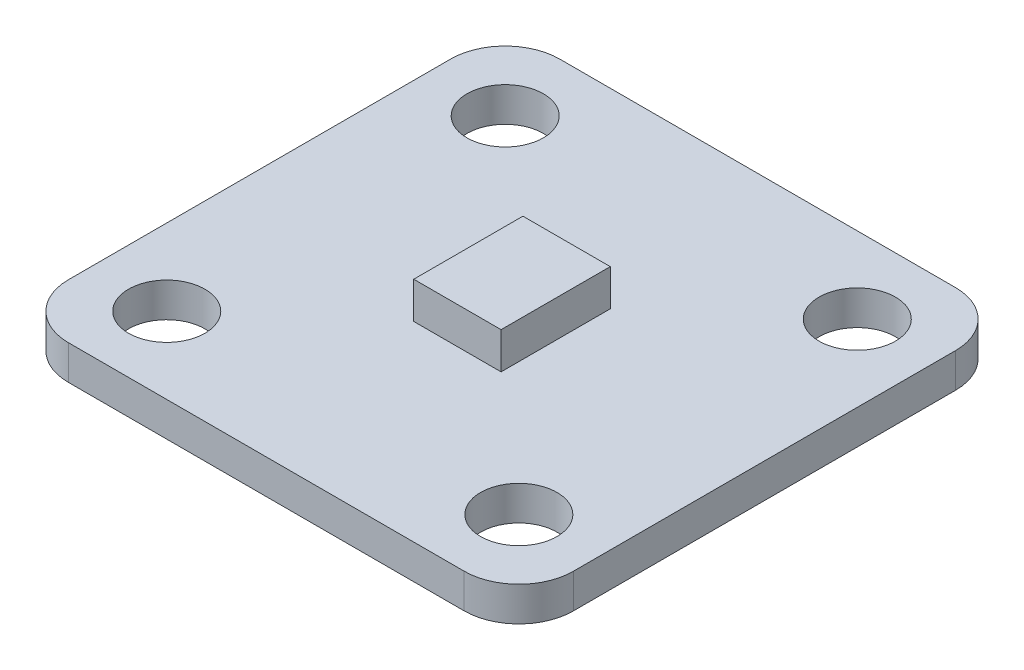
ISO-10303-21;
HEADER;
FILE_DESCRIPTION(('STEP AP214'),'2;1');
FILE_NAME('part.step','',(''),(''),'','','');
FILE_SCHEMA(('AUTOMOTIVE_DESIGN { 1 0 10303 214 1 1 1 1 }'));
ENDSEC;
DATA;
#1=APPLICATION_CONTEXT('core data for automotive mechanical design processes');
#2=APPLICATION_PROTOCOL_DEFINITION('international standard','automotive_design',2000,#1);
#3=PRODUCT_CONTEXT('',#1,'mechanical');
#4=PRODUCT('Part','Part','',(#3));
#5=PRODUCT_RELATED_PRODUCT_CATEGORY('part','',(#4));
#6=PRODUCT_DEFINITION_FORMATION('','',#4);
#7=PRODUCT_DEFINITION_CONTEXT('part definition',#1,'design');
#8=PRODUCT_DEFINITION('design','',#6,#7);
#9=PRODUCT_DEFINITION_SHAPE('','',#8);
#10=(LENGTH_UNIT() NAMED_UNIT(*) SI_UNIT(.MILLI.,.METRE.));
#11=(NAMED_UNIT(*) PLANE_ANGLE_UNIT() SI_UNIT($,.RADIAN.));
#12=(NAMED_UNIT(*) SI_UNIT($,.STERADIAN.) SOLID_ANGLE_UNIT());
#13=UNCERTAINTY_MEASURE_WITH_UNIT(LENGTH_MEASURE(1.E-05),#10,'distance_accuracy_value','');
#14=(GEOMETRIC_REPRESENTATION_CONTEXT(3) GLOBAL_UNCERTAINTY_ASSIGNED_CONTEXT((#13)) GLOBAL_UNIT_ASSIGNED_CONTEXT((#10,
#11,#12)) REPRESENTATION_CONTEXT('',''));
#15=CARTESIAN_POINT('',(0.,0.,0.));
#16=DIRECTION('',(0.,0.,1.));
#17=DIRECTION('',(1.,0.,0.));
#18=AXIS2_PLACEMENT_3D('',#15,#16,#17);
#19=CARTESIAN_POINT('',(0.,1.6002,0.));
#20=DIRECTION('',(0.,-1.,0.));
#21=DIRECTION('',(0.,0.,-1.));
#22=AXIS2_PLACEMENT_3D('',#19,#20,#21);
#23=PLANE('',#22);
#24=CARTESIAN_POINT('',(8.1915,1.6002,7.874));
#25=DIRECTION('',(0.,1.,0.));
#26=DIRECTION('',(0.,0.,1.));
#27=AXIS2_PLACEMENT_3D('',#24,#25,#26);
#28=CIRCLE('',#27,1.778);
#29=CARTESIAN_POINT('',(8.1915,1.6002,9.652));
#30=VERTEX_POINT('',#29);
#31=EDGE_CURVE('E470',#30,#30,#28,.T.);
#32=ORIENTED_EDGE('',*,*,#31,.F.);
#33=EDGE_LOOP('',(#32));
#34=FACE_BOUND('',#33,.T.);
#35=CARTESIAN_POINT('',(8.1915,1.6002,-7.87399999999999));
#36=DIRECTION('',(0.,1.,0.));
#37=DIRECTION('',(0.,0.,1.));
#38=AXIS2_PLACEMENT_3D('',#35,#36,#37);
#39=CIRCLE('',#38,1.778);
#40=CARTESIAN_POINT('',(8.1915,1.6002,-6.09599999999999));
#41=VERTEX_POINT('',#40);
#42=EDGE_CURVE('E478',#41,#41,#39,.T.);
#43=ORIENTED_EDGE('',*,*,#42,.F.);
#44=EDGE_LOOP('',(#43));
#45=FACE_BOUND('',#44,.T.);
#46=CARTESIAN_POINT('',(-8.1915,1.6002,-7.87399999999999));
#47=DIRECTION('',(0.,1.,0.));
#48=DIRECTION('',(0.,0.,1.));
#49=AXIS2_PLACEMENT_3D('',#46,#47,#48);
#50=CIRCLE('',#49,1.778);
#51=CARTESIAN_POINT('',(-8.1915,1.6002,-6.09599999999999));
#52=VERTEX_POINT('',#51);
#53=EDGE_CURVE('E486',#52,#52,#50,.T.);
#54=ORIENTED_EDGE('',*,*,#53,.F.);
#55=EDGE_LOOP('',(#54));
#56=FACE_BOUND('',#55,.T.);
#57=CARTESIAN_POINT('',(-8.1915,1.6002,7.874));
#58=DIRECTION('',(0.,1.,0.));
#59=DIRECTION('',(0.,0.,1.));
#60=AXIS2_PLACEMENT_3D('',#57,#58,#59);
#61=CIRCLE('',#60,1.778);
#62=CARTESIAN_POINT('',(-8.1915,1.6002,9.652));
#63=VERTEX_POINT('',#62);
#64=EDGE_CURVE('E462',#63,#63,#61,.T.);
#65=ORIENTED_EDGE('',*,*,#64,.F.);
#66=EDGE_LOOP('',(#65));
#67=FACE_BOUND('',#66,.T.);
#68=DIRECTION('',(-1.,0.,0.));
#69=VECTOR('',#68,1.);
#70=CARTESIAN_POINT('',(-11.7475,1.6002,-11.43));
#71=LINE('',#70,#69);
#72=CARTESIAN_POINT('',(9.2075,1.6002,-11.43));
#73=VERTEX_POINT('',#72);
#74=CARTESIAN_POINT('',(-9.2075,1.6002,-11.43));
#75=VERTEX_POINT('',#74);
#76=EDGE_CURVE('E171',#73,#75,#71,.T.);
#77=ORIENTED_EDGE('',*,*,#76,.T.);
#78=CARTESIAN_POINT('',(-9.2075,1.6002,-8.89));
#79=DIRECTION('',(0.,-1.,0.));
#80=DIRECTION('',(0.,0.,-1.));
#81=AXIS2_PLACEMENT_3D('',#78,#79,#80);
#82=CIRCLE('',#81,2.54);
#83=CARTESIAN_POINT('',(-11.7475,1.6002,-8.89));
#84=VERTEX_POINT('',#83);
#85=EDGE_CURVE('E225',#75,#84,#82,.F.);
#86=ORIENTED_EDGE('',*,*,#85,.T.);
#87=DIRECTION('',(0.,0.,1.));
#88=VECTOR('',#87,1.);
#89=CARTESIAN_POINT('',(-11.7475,1.6002,11.43));
#90=LINE('',#89,#88);
#91=CARTESIAN_POINT('',(-11.7475,1.6002,8.89));
#92=VERTEX_POINT('',#91);
#93=EDGE_CURVE('E176',#84,#92,#90,.T.);
#94=ORIENTED_EDGE('',*,*,#93,.T.);
#95=CARTESIAN_POINT('',(-9.2075,1.6002,8.89));
#96=DIRECTION('',(0.,-1.,0.));
#97=DIRECTION('',(0.,0.,-1.));
#98=AXIS2_PLACEMENT_3D('',#95,#96,#97);
#99=CIRCLE('',#98,2.54);
#100=CARTESIAN_POINT('',(-9.2075,1.6002,11.43));
#101=VERTEX_POINT('',#100);
#102=EDGE_CURVE('E59',#92,#101,#99,.F.);
#103=ORIENTED_EDGE('',*,*,#102,.T.);
#104=DIRECTION('',(1.,0.,0.));
#105=VECTOR('',#104,1.);
#106=CARTESIAN_POINT('',(-11.7475,1.6002,11.43));
#107=LINE('',#106,#105);
#108=CARTESIAN_POINT('',(9.2075,1.6002,11.43));
#109=VERTEX_POINT('',#108);
#110=EDGE_CURVE('E179',#101,#109,#107,.T.);
#111=ORIENTED_EDGE('',*,*,#110,.T.);
#112=CARTESIAN_POINT('',(9.2075,1.6002,8.89));
#113=DIRECTION('',(0.,-1.,0.));
#114=DIRECTION('',(0.,0.,-1.));
#115=AXIS2_PLACEMENT_3D('',#112,#113,#114);
#116=CIRCLE('',#115,2.54);
#117=CARTESIAN_POINT('',(11.7475,1.6002,8.89));
#118=VERTEX_POINT('',#117);
#119=EDGE_CURVE('E219',#109,#118,#116,.F.);
#120=ORIENTED_EDGE('',*,*,#119,.T.);
#121=DIRECTION('',(0.,0.,-1.));
#122=VECTOR('',#121,1.);
#123=CARTESIAN_POINT('',(11.7475,1.6002,11.43));
#124=LINE('',#123,#122);
#125=CARTESIAN_POINT('',(11.7475,1.6002,-8.89));
#126=VERTEX_POINT('',#125);
#127=EDGE_CURVE('E167',#118,#126,#124,.T.);
#128=ORIENTED_EDGE('',*,*,#127,.T.);
#129=CARTESIAN_POINT('',(9.2075,1.6002,-8.89));
#130=DIRECTION('',(0.,-1.,0.));
#131=DIRECTION('',(0.,0.,-1.));
#132=AXIS2_PLACEMENT_3D('',#129,#130,#131);
#133=CIRCLE('',#132,2.54);
#134=EDGE_CURVE('E222',#126,#73,#133,.F.);
#135=ORIENTED_EDGE('',*,*,#134,.T.);
#136=EDGE_LOOP('',(#77,#86,#94,#103,#111,#120,#128,#135));
#137=FACE_BOUND('',#136,.T.);
#138=DIRECTION('',(0.,0.,-1.));
#139=VECTOR('',#138,1.);
#140=CARTESIAN_POINT('',(2.032,1.6002,2.54));
#141=LINE('',#140,#139);
#142=CARTESIAN_POINT('',(2.032,1.6002,2.54));
#143=VERTEX_POINT('',#142);
#144=CARTESIAN_POINT('',(2.032,1.6002,-2.54));
#145=VERTEX_POINT('',#144);
#146=EDGE_CURVE('E154',#143,#145,#141,.T.);
#147=ORIENTED_EDGE('',*,*,#146,.F.);
#148=DIRECTION('',(1.,0.,0.));
#149=VECTOR('',#148,1.);
#150=CARTESIAN_POINT('',(-2.032,1.6002,2.54));
#151=LINE('',#150,#149);
#152=CARTESIAN_POINT('',(-2.032,1.6002,2.54));
#153=VERTEX_POINT('',#152);
#154=EDGE_CURVE('E151',#153,#143,#151,.T.);
#155=ORIENTED_EDGE('',*,*,#154,.F.);
#156=DIRECTION('',(0.,0.,1.));
#157=VECTOR('',#156,1.);
#158=CARTESIAN_POINT('',(-2.032,1.6002,2.54));
#159=LINE('',#158,#157);
#160=CARTESIAN_POINT('',(-2.032,1.6002,-2.54));
#161=VERTEX_POINT('',#160);
#162=EDGE_CURVE('E440',#161,#153,#159,.T.);
#163=ORIENTED_EDGE('',*,*,#162,.F.);
#164=DIRECTION('',(-1.,0.,0.));
#165=VECTOR('',#164,1.);
#166=CARTESIAN_POINT('',(-2.032,1.6002,-2.54));
#167=LINE('',#166,#165);
#168=EDGE_CURVE('E443',#145,#161,#167,.T.);
#169=ORIENTED_EDGE('',*,*,#168,.F.);
#170=EDGE_LOOP('',(#147,#155,#163,#169));
#171=FACE_BOUND('',#170,.T.);
#172=ADVANCED_FACE('F38',(#34,#45,#56,#67,#137,#171),#23,.F.);
#173=CARTESIAN_POINT('',(11.7475,1.6002,11.43));
#174=DIRECTION('',(-1.,0.,0.));
#175=DIRECTION('',(0.,0.,1.));
#176=AXIS2_PLACEMENT_3D('',#173,#174,#175);
#177=PLANE('',#176);
#178=DIRECTION('',(0.,0.,-1.));
#179=VECTOR('',#178,1.);
#180=CARTESIAN_POINT('',(11.7475,0.,11.43));
#181=LINE('',#180,#179);
#182=CARTESIAN_POINT('',(11.7475,0.,8.89));
#183=VERTEX_POINT('',#182);
#184=CARTESIAN_POINT('',(11.7475,0.,-8.89));
#185=VERTEX_POINT('',#184);
#186=EDGE_CURVE('E156',#183,#185,#181,.T.);
#187=ORIENTED_EDGE('',*,*,#186,.T.);
#188=DIRECTION('',(0.,-1.,0.));
#189=VECTOR('',#188,1.);
#190=CARTESIAN_POINT('',(11.7475,1.6002,-8.89));
#191=LINE('',#190,#189);
#192=EDGE_CURVE('E232',#185,#126,#191,.F.);
#193=ORIENTED_EDGE('',*,*,#192,.T.);
#194=ORIENTED_EDGE('',*,*,#127,.F.);
#195=DIRECTION('',(0.,-1.,0.));
#196=VECTOR('',#195,1.);
#197=CARTESIAN_POINT('',(11.7475,1.6002,8.89));
#198=LINE('',#197,#196);
#199=EDGE_CURVE('E228',#118,#183,#198,.T.);
#200=ORIENTED_EDGE('',*,*,#199,.T.);
#201=EDGE_LOOP('',(#187,#193,#194,#200));
#202=FACE_BOUND('',#201,.T.);
#203=ADVANCED_FACE('F250',(#202),#177,.F.);
#204=CARTESIAN_POINT('',(-11.7475,1.6002,-11.43));
#205=DIRECTION('',(0.,0.,1.));
#206=DIRECTION('',(1.,0.,0.));
#207=AXIS2_PLACEMENT_3D('',#204,#205,#206);
#208=PLANE('',#207);
#209=DIRECTION('',(-1.,0.,0.));
#210=VECTOR('',#209,1.);
#211=CARTESIAN_POINT('',(-11.7475,0.,-11.43));
#212=LINE('',#211,#210);
#213=CARTESIAN_POINT('',(9.2075,0.,-11.43));
#214=VERTEX_POINT('',#213);
#215=CARTESIAN_POINT('',(-9.2075,0.,-11.43));
#216=VERTEX_POINT('',#215);
#217=EDGE_CURVE('E161',#214,#216,#212,.T.);
#218=ORIENTED_EDGE('',*,*,#217,.T.);
#219=DIRECTION('',(0.,-1.,0.));
#220=VECTOR('',#219,1.);
#221=CARTESIAN_POINT('',(-9.2075,1.6002,-11.43));
#222=LINE('',#221,#220);
#223=EDGE_CURVE('E214',#216,#75,#222,.F.);
#224=ORIENTED_EDGE('',*,*,#223,.T.);
#225=ORIENTED_EDGE('',*,*,#76,.F.);
#226=DIRECTION('',(0.,-1.,0.));
#227=VECTOR('',#226,1.);
#228=CARTESIAN_POINT('',(9.2075,1.6002,-11.43));
#229=LINE('',#228,#227);
#230=EDGE_CURVE('E210',#73,#214,#229,.T.);
#231=ORIENTED_EDGE('',*,*,#230,.T.);
#232=EDGE_LOOP('',(#218,#224,#225,#231));
#233=FACE_BOUND('',#232,.T.);
#234=ADVANCED_FACE('F260',(#233),#208,.F.);
#235=CARTESIAN_POINT('',(-11.7475,1.6002,11.43));
#236=DIRECTION('',(1.,0.,0.));
#237=DIRECTION('',(0.,0.,-1.));
#238=AXIS2_PLACEMENT_3D('',#235,#236,#237);
#239=PLANE('',#238);
#240=ORIENTED_EDGE('',*,*,#93,.F.);
#241=DIRECTION('',(0.,-1.,0.));
#242=VECTOR('',#241,1.);
#243=CARTESIAN_POINT('',(-11.7475,1.6002,-8.89));
#244=LINE('',#243,#242);
#245=CARTESIAN_POINT('',(-11.7475,0.,-8.89));
#246=VERTEX_POINT('',#245);
#247=EDGE_CURVE('E194',#84,#246,#244,.T.);
#248=ORIENTED_EDGE('',*,*,#247,.T.);
#249=DIRECTION('',(0.,0.,1.));
#250=VECTOR('',#249,1.);
#251=CARTESIAN_POINT('',(-11.7475,0.,11.43));
#252=LINE('',#251,#250);
#253=CARTESIAN_POINT('',(-11.7475,0.,8.89));
#254=VERTEX_POINT('',#253);
#255=EDGE_CURVE('E186',#246,#254,#252,.T.);
#256=ORIENTED_EDGE('',*,*,#255,.T.);
#257=DIRECTION('',(0.,-1.,0.));
#258=VECTOR('',#257,1.);
#259=CARTESIAN_POINT('',(-11.7475,1.6002,8.89));
#260=LINE('',#259,#258);
#261=EDGE_CURVE('E181',#254,#92,#260,.F.);
#262=ORIENTED_EDGE('',*,*,#261,.T.);
#263=EDGE_LOOP('',(#240,#248,#256,#262));
#264=FACE_BOUND('',#263,.T.);
#265=ADVANCED_FACE('F268',(#264),#239,.F.);
#266=CARTESIAN_POINT('',(-11.7475,1.6002,11.43));
#267=DIRECTION('',(0.,0.,-1.));
#268=DIRECTION('',(-1.,0.,0.));
#269=AXIS2_PLACEMENT_3D('',#266,#267,#268);
#270=PLANE('',#269);
#271=DIRECTION('',(1.,0.,0.));
#272=VECTOR('',#271,1.);
#273=CARTESIAN_POINT('',(-11.7475,0.,11.43));
#274=LINE('',#273,#272);
#275=CARTESIAN_POINT('',(-9.2075,0.,11.43));
#276=VERTEX_POINT('',#275);
#277=CARTESIAN_POINT('',(9.2075,0.,11.43));
#278=VERTEX_POINT('',#277);
#279=EDGE_CURVE('E172',#276,#278,#274,.T.);
#280=ORIENTED_EDGE('',*,*,#279,.T.);
#281=DIRECTION('',(0.,-1.,0.));
#282=VECTOR('',#281,1.);
#283=CARTESIAN_POINT('',(9.2075,1.6002,11.43));
#284=LINE('',#283,#282);
#285=EDGE_CURVE('E11',#278,#109,#284,.F.);
#286=ORIENTED_EDGE('',*,*,#285,.T.);
#287=ORIENTED_EDGE('',*,*,#110,.F.);
#288=DIRECTION('',(0.,-1.,0.));
#289=VECTOR('',#288,1.);
#290=CARTESIAN_POINT('',(-9.2075,1.6002,11.43));
#291=LINE('',#290,#289);
#292=EDGE_CURVE('E47',#101,#276,#291,.T.);
#293=ORIENTED_EDGE('',*,*,#292,.T.);
#294=EDGE_LOOP('',(#280,#286,#287,#293));
#295=FACE_BOUND('',#294,.T.);
#296=ADVANCED_FACE('F238',(#295),#270,.F.);
#297=CARTESIAN_POINT('',(0.,0.,0.));
#298=DIRECTION('',(0.,-1.,0.));
#299=DIRECTION('',(0.,0.,-1.));
#300=AXIS2_PLACEMENT_3D('',#297,#298,#299);
#301=PLANE('',#300);
#302=CARTESIAN_POINT('',(8.1915,0.,7.874));
#303=DIRECTION('',(0.,1.,0.));
#304=DIRECTION('',(0.,0.,1.));
#305=AXIS2_PLACEMENT_3D('',#302,#303,#304);
#306=CIRCLE('',#305,1.778);
#307=CARTESIAN_POINT('',(8.1915,0.,9.652));
#308=VERTEX_POINT('',#307);
#309=EDGE_CURVE('E474',#308,#308,#306,.T.);
#310=ORIENTED_EDGE('',*,*,#309,.T.);
#311=EDGE_LOOP('',(#310));
#312=FACE_BOUND('',#311,.T.);
#313=CARTESIAN_POINT('',(8.1915,0.,-7.87399999999999));
#314=DIRECTION('',(0.,1.,0.));
#315=DIRECTION('',(0.,0.,1.));
#316=AXIS2_PLACEMENT_3D('',#313,#314,#315);
#317=CIRCLE('',#316,1.778);
#318=CARTESIAN_POINT('',(8.1915,0.,-6.09599999999999));
#319=VERTEX_POINT('',#318);
#320=EDGE_CURVE('E482',#319,#319,#317,.T.);
#321=ORIENTED_EDGE('',*,*,#320,.T.);
#322=EDGE_LOOP('',(#321));
#323=FACE_BOUND('',#322,.T.);
#324=CARTESIAN_POINT('',(-8.1915,0.,-7.87399999999999));
#325=DIRECTION('',(0.,1.,0.));
#326=DIRECTION('',(0.,0.,1.));
#327=AXIS2_PLACEMENT_3D('',#324,#325,#326);
#328=CIRCLE('',#327,1.778);
#329=CARTESIAN_POINT('',(-8.1915,0.,-6.09599999999999));
#330=VERTEX_POINT('',#329);
#331=EDGE_CURVE('E466',#330,#330,#328,.T.);
#332=ORIENTED_EDGE('',*,*,#331,.T.);
#333=EDGE_LOOP('',(#332));
#334=FACE_BOUND('',#333,.T.);
#335=CARTESIAN_POINT('',(-8.1915,0.,7.874));
#336=DIRECTION('',(0.,1.,0.));
#337=DIRECTION('',(0.,0.,1.));
#338=AXIS2_PLACEMENT_3D('',#335,#336,#337);
#339=CIRCLE('',#338,1.778);
#340=CARTESIAN_POINT('',(-8.1915,0.,9.652));
#341=VERTEX_POINT('',#340);
#342=EDGE_CURVE('E457',#341,#341,#339,.T.);
#343=ORIENTED_EDGE('',*,*,#342,.T.);
#344=EDGE_LOOP('',(#343));
#345=FACE_BOUND('',#344,.T.);
#346=ORIENTED_EDGE('',*,*,#255,.F.);
#347=CARTESIAN_POINT('',(-9.2075,0.,-8.89));
#348=DIRECTION('',(0.,-1.,0.));
#349=DIRECTION('',(0.,0.,-1.));
#350=AXIS2_PLACEMENT_3D('',#347,#348,#349);
#351=CIRCLE('',#350,2.54);
#352=EDGE_CURVE('E207',#246,#216,#351,.T.);
#353=ORIENTED_EDGE('',*,*,#352,.T.);
#354=ORIENTED_EDGE('',*,*,#217,.F.);
#355=CARTESIAN_POINT('',(9.2075,0.,-8.89));
#356=DIRECTION('',(0.,-1.,0.));
#357=DIRECTION('',(0.,0.,-1.));
#358=AXIS2_PLACEMENT_3D('',#355,#356,#357);
#359=CIRCLE('',#358,2.54);
#360=EDGE_CURVE('E204',#214,#185,#359,.T.);
#361=ORIENTED_EDGE('',*,*,#360,.T.);
#362=ORIENTED_EDGE('',*,*,#186,.F.);
#363=CARTESIAN_POINT('',(9.2075,0.,8.89));
#364=DIRECTION('',(0.,-1.,0.));
#365=DIRECTION('',(0.,0.,-1.));
#366=AXIS2_PLACEMENT_3D('',#363,#364,#365);
#367=CIRCLE('',#366,2.54);
#368=EDGE_CURVE('E201',#183,#278,#367,.T.);
#369=ORIENTED_EDGE('',*,*,#368,.T.);
#370=ORIENTED_EDGE('',*,*,#279,.F.);
#371=CARTESIAN_POINT('',(-9.2075,0.,8.89));
#372=DIRECTION('',(0.,-1.,0.));
#373=DIRECTION('',(0.,0.,-1.));
#374=AXIS2_PLACEMENT_3D('',#371,#372,#373);
#375=CIRCLE('',#374,2.54);
#376=EDGE_CURVE('E198',#276,#254,#375,.T.);
#377=ORIENTED_EDGE('',*,*,#376,.T.);
#378=EDGE_LOOP('',(#346,#353,#354,#361,#362,#369,#370,#377));
#379=FACE_BOUND('',#378,.T.);
#380=ADVANCED_FACE('F242',(#312,#323,#334,#345,#379),#301,.T.);
#381=CARTESIAN_POINT('',(2.032,3.302,2.54));
#382=DIRECTION('',(-1.,0.,0.));
#383=DIRECTION('',(0.,0.,1.));
#384=AXIS2_PLACEMENT_3D('',#381,#382,#383);
#385=PLANE('',#384);
#386=ORIENTED_EDGE('',*,*,#146,.T.);
#387=DIRECTION('',(0.,-1.,0.));
#388=VECTOR('',#387,1.);
#389=CARTESIAN_POINT('',(2.032,3.302,-2.54));
#390=LINE('',#389,#388);
#391=CARTESIAN_POINT('',(2.032,3.302,-2.54));
#392=VERTEX_POINT('',#391);
#393=EDGE_CURVE('E133',#392,#145,#390,.T.);
#394=ORIENTED_EDGE('',*,*,#393,.F.);
#395=DIRECTION('',(0.,0.,-1.));
#396=VECTOR('',#395,1.);
#397=CARTESIAN_POINT('',(2.032,3.302,2.54));
#398=LINE('',#397,#396);
#399=CARTESIAN_POINT('',(2.032,3.302,2.54));
#400=VERTEX_POINT('',#399);
#401=EDGE_CURVE('E141',#400,#392,#398,.T.);
#402=ORIENTED_EDGE('',*,*,#401,.F.);
#403=DIRECTION('',(0.,-1.,0.));
#404=VECTOR('',#403,1.);
#405=CARTESIAN_POINT('',(2.032,3.302,2.54));
#406=LINE('',#405,#404);
#407=EDGE_CURVE('E447',#400,#143,#406,.T.);
#408=ORIENTED_EDGE('',*,*,#407,.T.);
#409=EDGE_LOOP('',(#386,#394,#402,#408));
#410=FACE_BOUND('',#409,.T.);
#411=ADVANCED_FACE('F153',(#410),#385,.F.);
#412=CARTESIAN_POINT('',(-2.032,3.302,-2.54));
#413=DIRECTION('',(0.,0.,1.));
#414=DIRECTION('',(1.,0.,0.));
#415=AXIS2_PLACEMENT_3D('',#412,#413,#414);
#416=PLANE('',#415);
#417=ORIENTED_EDGE('',*,*,#168,.T.);
#418=DIRECTION('',(0.,-1.,0.));
#419=VECTOR('',#418,1.);
#420=CARTESIAN_POINT('',(-2.032,3.302,-2.54));
#421=LINE('',#420,#419);
#422=CARTESIAN_POINT('',(-2.032,3.302,-2.54));
#423=VERTEX_POINT('',#422);
#424=EDGE_CURVE('E136',#423,#161,#421,.T.);
#425=ORIENTED_EDGE('',*,*,#424,.F.);
#426=DIRECTION('',(-1.,0.,0.));
#427=VECTOR('',#426,1.);
#428=CARTESIAN_POINT('',(-2.032,3.302,-2.54));
#429=LINE('',#428,#427);
#430=EDGE_CURVE('E128',#392,#423,#429,.T.);
#431=ORIENTED_EDGE('',*,*,#430,.F.);
#432=ORIENTED_EDGE('',*,*,#393,.T.);
#433=EDGE_LOOP('',(#417,#425,#431,#432));
#434=FACE_BOUND('',#433,.T.);
#435=ADVANCED_FACE('F131',(#434),#416,.F.);
#436=CARTESIAN_POINT('',(-2.032,3.302,2.54));
#437=DIRECTION('',(1.,0.,0.));
#438=DIRECTION('',(0.,0.,-1.));
#439=AXIS2_PLACEMENT_3D('',#436,#437,#438);
#440=PLANE('',#439);
#441=ORIENTED_EDGE('',*,*,#162,.T.);
#442=DIRECTION('',(0.,-1.,0.));
#443=VECTOR('',#442,1.);
#444=CARTESIAN_POINT('',(-2.032,3.302,2.54));
#445=LINE('',#444,#443);
#446=CARTESIAN_POINT('',(-2.032,3.302,2.54));
#447=VERTEX_POINT('',#446);
#448=EDGE_CURVE('E163',#447,#153,#445,.T.);
#449=ORIENTED_EDGE('',*,*,#448,.F.);
#450=DIRECTION('',(0.,0.,1.));
#451=VECTOR('',#450,1.);
#452=CARTESIAN_POINT('',(-2.032,3.302,2.54));
#453=LINE('',#452,#451);
#454=EDGE_CURVE('E140',#423,#447,#453,.T.);
#455=ORIENTED_EDGE('',*,*,#454,.F.);
#456=ORIENTED_EDGE('',*,*,#424,.T.);
#457=EDGE_LOOP('',(#441,#449,#455,#456));
#458=FACE_BOUND('',#457,.T.);
#459=ADVANCED_FACE('F375',(#458),#440,.F.);
#460=CARTESIAN_POINT('',(-2.032,3.302,2.54));
#461=DIRECTION('',(0.,0.,-1.));
#462=DIRECTION('',(-1.,0.,0.));
#463=AXIS2_PLACEMENT_3D('',#460,#461,#462);
#464=PLANE('',#463);
#465=ORIENTED_EDGE('',*,*,#154,.T.);
#466=ORIENTED_EDGE('',*,*,#407,.F.);
#467=DIRECTION('',(1.,0.,0.));
#468=VECTOR('',#467,1.);
#469=CARTESIAN_POINT('',(-2.032,3.302,2.54));
#470=LINE('',#469,#468);
#471=EDGE_CURVE('E146',#447,#400,#470,.T.);
#472=ORIENTED_EDGE('',*,*,#471,.F.);
#473=ORIENTED_EDGE('',*,*,#448,.T.);
#474=EDGE_LOOP('',(#465,#466,#472,#473));
#475=FACE_BOUND('',#474,.T.);
#476=ADVANCED_FACE('F372',(#475),#464,.F.);
#477=CARTESIAN_POINT('',(0.,3.302,0.));
#478=DIRECTION('',(0.,-1.,0.));
#479=DIRECTION('',(0.,0.,-1.));
#480=AXIS2_PLACEMENT_3D('',#477,#478,#479);
#481=PLANE('',#480);
#482=ORIENTED_EDGE('',*,*,#401,.T.);
#483=ORIENTED_EDGE('',*,*,#430,.T.);
#484=ORIENTED_EDGE('',*,*,#454,.T.);
#485=ORIENTED_EDGE('',*,*,#471,.T.);
#486=EDGE_LOOP('',(#482,#483,#484,#485));
#487=FACE_BOUND('',#486,.T.);
#488=ADVANCED_FACE('F144',(#487),#481,.F.);
#489=CARTESIAN_POINT('',(-9.2075,1.6002,-8.89));
#490=DIRECTION('',(0.,-1.,0.));
#491=DIRECTION('',(0.,0.,-1.));
#492=AXIS2_PLACEMENT_3D('',#489,#490,#491);
#493=CYLINDRICAL_SURFACE('',#492,2.54);
#494=ORIENTED_EDGE('',*,*,#85,.F.);
#495=ORIENTED_EDGE('',*,*,#223,.F.);
#496=ORIENTED_EDGE('',*,*,#352,.F.);
#497=ORIENTED_EDGE('',*,*,#247,.F.);
#498=EDGE_LOOP('',(#494,#495,#496,#497));
#499=FACE_BOUND('',#498,.T.);
#500=ADVANCED_FACE('F265',(#499),#493,.T.);
#501=CARTESIAN_POINT('',(9.2075,1.6002,-8.89));
#502=DIRECTION('',(0.,-1.,0.));
#503=DIRECTION('',(0.,0.,-1.));
#504=AXIS2_PLACEMENT_3D('',#501,#502,#503);
#505=CYLINDRICAL_SURFACE('',#504,2.54);
#506=ORIENTED_EDGE('',*,*,#134,.F.);
#507=ORIENTED_EDGE('',*,*,#192,.F.);
#508=ORIENTED_EDGE('',*,*,#360,.F.);
#509=ORIENTED_EDGE('',*,*,#230,.F.);
#510=EDGE_LOOP('',(#506,#507,#508,#509));
#511=FACE_BOUND('',#510,.T.);
#512=ADVANCED_FACE('F257',(#511),#505,.T.);
#513=CARTESIAN_POINT('',(9.2075,1.6002,8.89));
#514=DIRECTION('',(0.,-1.,0.));
#515=DIRECTION('',(0.,0.,-1.));
#516=AXIS2_PLACEMENT_3D('',#513,#514,#515);
#517=CYLINDRICAL_SURFACE('',#516,2.54);
#518=ORIENTED_EDGE('',*,*,#119,.F.);
#519=ORIENTED_EDGE('',*,*,#285,.F.);
#520=ORIENTED_EDGE('',*,*,#368,.F.);
#521=ORIENTED_EDGE('',*,*,#199,.F.);
#522=EDGE_LOOP('',(#518,#519,#520,#521));
#523=FACE_BOUND('',#522,.T.);
#524=ADVANCED_FACE('F247',(#523),#517,.T.);
#525=CARTESIAN_POINT('',(-9.2075,1.6002,8.89));
#526=DIRECTION('',(0.,-1.,0.));
#527=DIRECTION('',(0.,0.,-1.));
#528=AXIS2_PLACEMENT_3D('',#525,#526,#527);
#529=CYLINDRICAL_SURFACE('',#528,2.54);
#530=ORIENTED_EDGE('',*,*,#102,.F.);
#531=ORIENTED_EDGE('',*,*,#261,.F.);
#532=ORIENTED_EDGE('',*,*,#376,.F.);
#533=ORIENTED_EDGE('',*,*,#292,.F.);
#534=EDGE_LOOP('',(#530,#531,#532,#533));
#535=FACE_BOUND('',#534,.T.);
#536=ADVANCED_FACE('F40',(#535),#529,.T.);
#537=CARTESIAN_POINT('',(-8.1915,0.,7.874));
#538=DIRECTION('',(0.,1.,0.));
#539=DIRECTION('',(0.,0.,1.));
#540=AXIS2_PLACEMENT_3D('',#537,#538,#539);
#541=CYLINDRICAL_SURFACE('',#540,1.778);
#542=ORIENTED_EDGE('',*,*,#342,.F.);
#543=EDGE_LOOP('',(#542));
#544=FACE_BOUND('',#543,.T.);
#545=ORIENTED_EDGE('',*,*,#64,.T.);
#546=EDGE_LOOP('',(#545));
#547=FACE_BOUND('',#546,.T.);
#548=ADVANCED_FACE('F271',(#544,#547),#541,.F.);
#549=CARTESIAN_POINT('',(-8.1915,0.,-7.87399999999999));
#550=DIRECTION('',(0.,1.,0.));
#551=DIRECTION('',(0.,0.,1.));
#552=AXIS2_PLACEMENT_3D('',#549,#550,#551);
#553=CYLINDRICAL_SURFACE('',#552,1.778);
#554=ORIENTED_EDGE('',*,*,#331,.F.);
#555=EDGE_LOOP('',(#554));
#556=FACE_BOUND('',#555,.T.);
#557=ORIENTED_EDGE('',*,*,#53,.T.);
#558=EDGE_LOOP('',(#557));
#559=FACE_BOUND('',#558,.T.);
#560=ADVANCED_FACE('F276',(#556,#559),#553,.F.);
#561=CARTESIAN_POINT('',(8.1915,0.,-7.87399999999999));
#562=DIRECTION('',(0.,1.,0.));
#563=DIRECTION('',(0.,0.,1.));
#564=AXIS2_PLACEMENT_3D('',#561,#562,#563);
#565=CYLINDRICAL_SURFACE('',#564,1.778);
#566=ORIENTED_EDGE('',*,*,#320,.F.);
#567=EDGE_LOOP('',(#566));
#568=FACE_BOUND('',#567,.T.);
#569=ORIENTED_EDGE('',*,*,#42,.T.);
#570=EDGE_LOOP('',(#569));
#571=FACE_BOUND('',#570,.T.);
#572=ADVANCED_FACE('F344',(#568,#571),#565,.F.);
#573=CARTESIAN_POINT('',(8.1915,0.,7.874));
#574=DIRECTION('',(0.,1.,0.));
#575=DIRECTION('',(0.,0.,1.));
#576=AXIS2_PLACEMENT_3D('',#573,#574,#575);
#577=CYLINDRICAL_SURFACE('',#576,1.778);
#578=ORIENTED_EDGE('',*,*,#309,.F.);
#579=EDGE_LOOP('',(#578));
#580=FACE_BOUND('',#579,.T.);
#581=ORIENTED_EDGE('',*,*,#31,.T.);
#582=EDGE_LOOP('',(#581));
#583=FACE_BOUND('',#582,.T.);
#584=ADVANCED_FACE('F354',(#580,#583),#577,.F.);
#585=CLOSED_SHELL('',(#172,#203,#234,#265,#296,#380,#411,#435,#459,#476,#488,#500,#512,#524,
#536,#548,#560,#572,#584));
#586=MANIFOLD_SOLID_BREP('B2',#585);
#587=ADVANCED_BREP_SHAPE_REPRESENTATION('',(#18,#586),#14);
#588=SHAPE_DEFINITION_REPRESENTATION(#9,#587);
ENDSEC;
END-ISO-10303-21;
